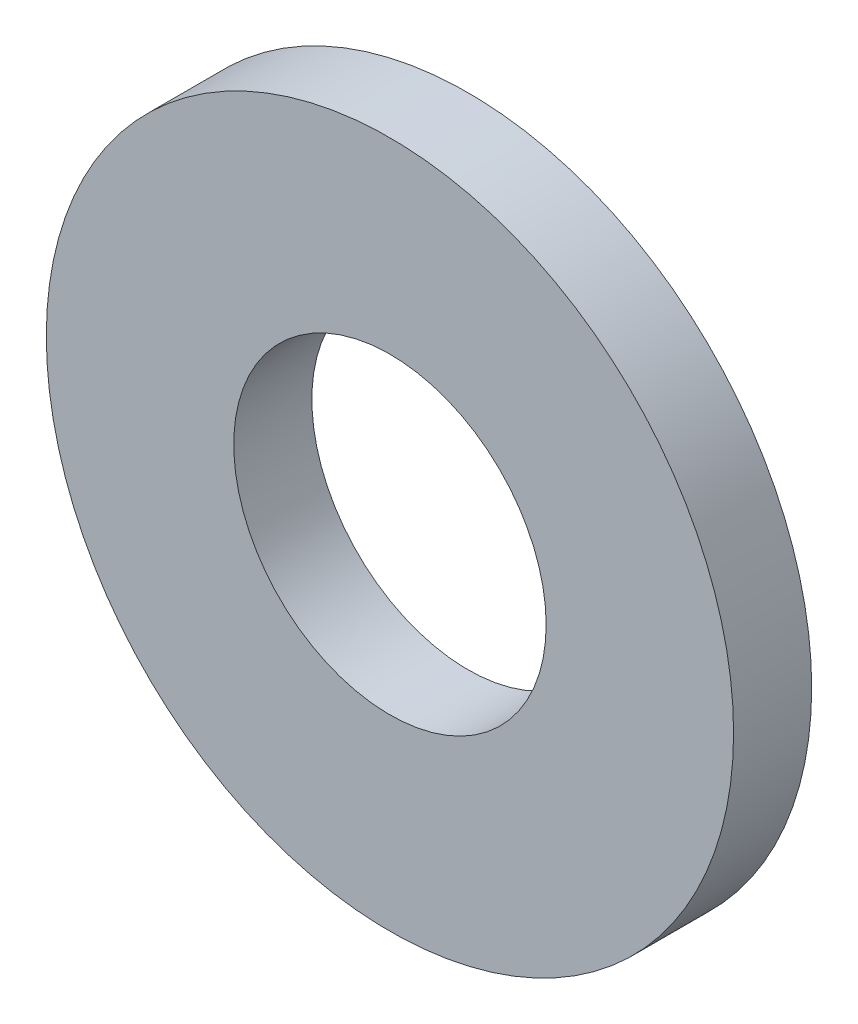
ISO-10303-21;
HEADER;
FILE_DESCRIPTION(('STEP AP214'),'2;1');
FILE_NAME('part.step','',(''),(''),'','','');
FILE_SCHEMA(('AUTOMOTIVE_DESIGN { 1 0 10303 214 1 1 1 1 }'));
ENDSEC;
DATA;
#1=APPLICATION_CONTEXT('core data for automotive mechanical design processes');
#2=APPLICATION_PROTOCOL_DEFINITION('international standard','automotive_design',2000,#1);
#3=PRODUCT_CONTEXT('',#1,'mechanical');
#4=PRODUCT('Part','Part','',(#3));
#5=PRODUCT_RELATED_PRODUCT_CATEGORY('part','',(#4));
#6=PRODUCT_DEFINITION_FORMATION('','',#4);
#7=PRODUCT_DEFINITION_CONTEXT('part definition',#1,'design');
#8=PRODUCT_DEFINITION('design','',#6,#7);
#9=PRODUCT_DEFINITION_SHAPE('','',#8);
#10=(LENGTH_UNIT() NAMED_UNIT(*) SI_UNIT(.MILLI.,.METRE.));
#11=(NAMED_UNIT(*) PLANE_ANGLE_UNIT() SI_UNIT($,.RADIAN.));
#12=(NAMED_UNIT(*) SI_UNIT($,.STERADIAN.) SOLID_ANGLE_UNIT());
#13=UNCERTAINTY_MEASURE_WITH_UNIT(LENGTH_MEASURE(1.E-05),#10,'distance_accuracy_value','');
#14=(GEOMETRIC_REPRESENTATION_CONTEXT(3) GLOBAL_UNCERTAINTY_ASSIGNED_CONTEXT((#13)) GLOBAL_UNIT_ASSIGNED_CONTEXT((#10,
#11,#12)) REPRESENTATION_CONTEXT('',''));
#15=CARTESIAN_POINT('',(0.,0.,0.));
#16=DIRECTION('',(0.,0.,1.));
#17=DIRECTION('',(1.,0.,0.));
#18=AXIS2_PLACEMENT_3D('',#15,#16,#17);
#19=CARTESIAN_POINT('',(0.,0.,-1.27));
#20=DIRECTION('',(0.,0.,1.));
#21=DIRECTION('',(1.,0.,0.));
#22=AXIS2_PLACEMENT_3D('',#19,#20,#21);
#23=CYLINDRICAL_SURFACE('',#22,5.588);
#24=CARTESIAN_POINT('',(0.,0.,-1.27));
#25=DIRECTION('',(0.,0.,1.));
#26=DIRECTION('',(1.,0.,0.));
#27=AXIS2_PLACEMENT_3D('',#24,#25,#26);
#28=CIRCLE('',#27,5.588);
#29=CARTESIAN_POINT('',(5.588,0.,-1.27));
#30=VERTEX_POINT('',#29);
#31=EDGE_CURVE('E10',#30,#30,#28,.T.);
#32=ORIENTED_EDGE('',*,*,#31,.T.);
#33=EDGE_LOOP('',(#32));
#34=FACE_BOUND('',#33,.T.);
#35=CARTESIAN_POINT('',(0.,0.,0.));
#36=DIRECTION('',(0.,0.,1.));
#37=DIRECTION('',(1.,0.,0.));
#38=AXIS2_PLACEMENT_3D('',#35,#36,#37);
#39=CIRCLE('',#38,5.588);
#40=CARTESIAN_POINT('',(5.588,0.,0.));
#41=VERTEX_POINT('',#40);
#42=EDGE_CURVE('E35',#41,#41,#39,.T.);
#43=ORIENTED_EDGE('',*,*,#42,.F.);
#44=EDGE_LOOP('',(#43));
#45=FACE_BOUND('',#44,.T.);
#46=ADVANCED_FACE('F32',(#34,#45),#23,.T.);
#47=CARTESIAN_POINT('',(0.,0.,-1.27));
#48=DIRECTION('',(0.,0.,1.));
#49=DIRECTION('',(1.,0.,0.));
#50=AXIS2_PLACEMENT_3D('',#47,#48,#49);
#51=PLANE('',#50);
#52=CARTESIAN_POINT('',(0.,0.,-1.27));
#53=DIRECTION('',(0.,0.,1.));
#54=DIRECTION('',(1.,0.,0.));
#55=AXIS2_PLACEMENT_3D('',#52,#53,#54);
#56=CIRCLE('',#55,2.54);
#57=CARTESIAN_POINT('',(2.54,0.,-1.27));
#58=VERTEX_POINT('',#57);
#59=EDGE_CURVE('E42',#58,#58,#56,.T.);
#60=ORIENTED_EDGE('',*,*,#59,.T.);
#61=EDGE_LOOP('',(#60));
#62=FACE_BOUND('',#61,.T.);
#63=ORIENTED_EDGE('',*,*,#31,.F.);
#64=EDGE_LOOP('',(#63));
#65=FACE_BOUND('',#64,.T.);
#66=ADVANCED_FACE('F50',(#62,#65),#51,.F.);
#67=CARTESIAN_POINT('',(0.,0.,0.));
#68=DIRECTION('',(0.,0.,1.));
#69=DIRECTION('',(1.,0.,0.));
#70=AXIS2_PLACEMENT_3D('',#67,#68,#69);
#71=PLANE('',#70);
#72=CARTESIAN_POINT('',(0.,0.,0.));
#73=DIRECTION('',(0.,0.,1.));
#74=DIRECTION('',(1.,0.,0.));
#75=AXIS2_PLACEMENT_3D('',#72,#73,#74);
#76=CIRCLE('',#75,2.54);
#77=CARTESIAN_POINT('',(2.54,0.,0.));
#78=VERTEX_POINT('',#77);
#79=EDGE_CURVE('E44',#78,#78,#76,.T.);
#80=ORIENTED_EDGE('',*,*,#79,.F.);
#81=EDGE_LOOP('',(#80));
#82=FACE_BOUND('',#81,.T.);
#83=ORIENTED_EDGE('',*,*,#42,.T.);
#84=EDGE_LOOP('',(#83));
#85=FACE_BOUND('',#84,.T.);
#86=ADVANCED_FACE('F56',(#82,#85),#71,.T.);
#87=CARTESIAN_POINT('',(0.,0.,-1.27));
#88=DIRECTION('',(0.,0.,1.));
#89=DIRECTION('',(1.,0.,0.));
#90=AXIS2_PLACEMENT_3D('',#87,#88,#89);
#91=CYLINDRICAL_SURFACE('',#90,2.54);
#92=ORIENTED_EDGE('',*,*,#59,.F.);
#93=EDGE_LOOP('',(#92));
#94=FACE_BOUND('',#93,.T.);
#95=ORIENTED_EDGE('',*,*,#79,.T.);
#96=EDGE_LOOP('',(#95));
#97=FACE_BOUND('',#96,.T.);
#98=ADVANCED_FACE('F53',(#94,#97),#91,.F.);
#99=CLOSED_SHELL('',(#46,#66,#86,#98));
#100=MANIFOLD_SOLID_BREP('B2',#99);
#101=ADVANCED_BREP_SHAPE_REPRESENTATION('',(#18,#100),#14);
#102=SHAPE_DEFINITION_REPRESENTATION(#9,#101);
ENDSEC;
END-ISO-10303-21;
